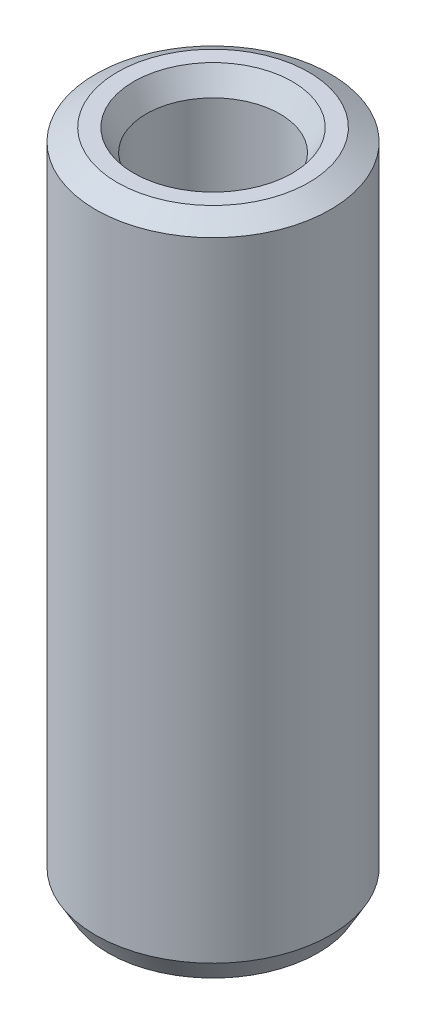
ISO-10303-21;
HEADER;
FILE_DESCRIPTION(('STEP AP214'),'2;1');
FILE_NAME('part.step','',(''),(''),'','','');
FILE_SCHEMA(('AUTOMOTIVE_DESIGN { 1 0 10303 214 1 1 1 1 }'));
ENDSEC;
DATA;
#1=APPLICATION_CONTEXT('core data for automotive mechanical design processes');
#2=APPLICATION_PROTOCOL_DEFINITION('international standard','automotive_design',2000,#1);
#3=PRODUCT_CONTEXT('',#1,'mechanical');
#4=PRODUCT('Part','Part','',(#3));
#5=PRODUCT_RELATED_PRODUCT_CATEGORY('part','',(#4));
#6=PRODUCT_DEFINITION_FORMATION('','',#4);
#7=PRODUCT_DEFINITION_CONTEXT('part definition',#1,'design');
#8=PRODUCT_DEFINITION('design','',#6,#7);
#9=PRODUCT_DEFINITION_SHAPE('','',#8);
#10=(LENGTH_UNIT() NAMED_UNIT(*) SI_UNIT(.MILLI.,.METRE.));
#11=(NAMED_UNIT(*) PLANE_ANGLE_UNIT() SI_UNIT($,.RADIAN.));
#12=(NAMED_UNIT(*) SI_UNIT($,.STERADIAN.) SOLID_ANGLE_UNIT());
#13=UNCERTAINTY_MEASURE_WITH_UNIT(LENGTH_MEASURE(1.E-05),#10,'distance_accuracy_value','');
#14=(GEOMETRIC_REPRESENTATION_CONTEXT(3) GLOBAL_UNCERTAINTY_ASSIGNED_CONTEXT((#13)) GLOBAL_UNIT_ASSIGNED_CONTEXT((#10,
#11,#12)) REPRESENTATION_CONTEXT('',''));
#15=CARTESIAN_POINT('',(0.,0.,0.));
#16=DIRECTION('',(0.,0.,1.));
#17=DIRECTION('',(1.,0.,0.));
#18=AXIS2_PLACEMENT_3D('',#15,#16,#17);
#19=CARTESIAN_POINT('',(0.,112.831708048129,0.));
#20=DIRECTION('',(0.,-1.,0.));
#21=DIRECTION('',(0.,0.,-1.));
#22=AXIS2_PLACEMENT_3D('',#19,#20,#21);
#23=CYLINDRICAL_SURFACE('',#22,20.);
#24=CARTESIAN_POINT('',(0.,3.69726768255808,0.));
#25=DIRECTION('',(0.,1.,0.));
#26=DIRECTION('',(0.,0.,1.));
#27=AXIS2_PLACEMENT_3D('',#24,#25,#26);
#28=CIRCLE('',#27,20.);
#29=CARTESIAN_POINT('',(0.,3.69726768255808,20.));
#30=VERTEX_POINT('',#29);
#31=EDGE_CURVE('E10',#30,#30,#28,.T.);
#32=ORIENTED_EDGE('',*,*,#31,.T.);
#33=EDGE_LOOP('',(#32));
#34=FACE_BOUND('',#33,.T.);
#35=CARTESIAN_POINT('',(0.,110.697089556338,0.));
#36=DIRECTION('',(0.,1.,0.));
#37=DIRECTION('',(0.,0.,1.));
#38=AXIS2_PLACEMENT_3D('',#35,#36,#37);
#39=CIRCLE('',#38,20.);
#40=CARTESIAN_POINT('',(0.,110.697089556338,20.));
#41=VERTEX_POINT('',#40);
#42=EDGE_CURVE('E50',#41,#41,#39,.F.);
#43=ORIENTED_EDGE('',*,*,#42,.T.);
#44=EDGE_LOOP('',(#43));
#45=FACE_BOUND('',#44,.T.);
#46=ADVANCED_FACE('F39',(#34,#45),#23,.T.);
#47=CARTESIAN_POINT('',(0.,112.831708048129,0.));
#48=DIRECTION('',(0.,1.,0.));
#49=DIRECTION('',(0.,0.,1.));
#50=AXIS2_PLACEMENT_3D('',#47,#48,#49);
#51=PLANE('',#50);
#52=CARTESIAN_POINT('',(0.,112.831708048129,0.));
#53=DIRECTION('',(0.,1.,0.));
#54=DIRECTION('',(0.,0.,1.));
#55=AXIS2_PLACEMENT_3D('',#52,#53,#54);
#56=CIRCLE('',#55,13.5146032053586);
#57=CARTESIAN_POINT('',(0.,112.831708048129,13.5146032053586));
#58=VERTEX_POINT('',#57);
#59=EDGE_CURVE('E58',#58,#58,#56,.F.);
#60=ORIENTED_EDGE('',*,*,#59,.T.);
#61=EDGE_LOOP('',(#60));
#62=FACE_BOUND('',#61,.T.);
#63=CARTESIAN_POINT('',(0.,112.831708048129,0.));
#64=DIRECTION('',(0.,1.,0.));
#65=DIRECTION('',(0.,0.,1.));
#66=AXIS2_PLACEMENT_3D('',#63,#64,#65);
#67=CIRCLE('',#66,16.3027323174419);
#68=CARTESIAN_POINT('',(0.,112.831708048129,16.3027323174419));
#69=VERTEX_POINT('',#68);
#70=EDGE_CURVE('E61',#69,#69,#67,.T.);
#71=ORIENTED_EDGE('',*,*,#70,.T.);
#72=EDGE_LOOP('',(#71));
#73=FACE_BOUND('',#72,.T.);
#74=ADVANCED_FACE('F88',(#62,#73),#51,.T.);
#75=CARTESIAN_POINT('',(0.,0.,0.));
#76=DIRECTION('',(0.,1.,0.));
#77=DIRECTION('',(0.,0.,1.));
#78=AXIS2_PLACEMENT_3D('',#75,#76,#77);
#79=PLANE('',#78);
#80=CARTESIAN_POINT('',(0.,0.,0.));
#81=DIRECTION('',(0.,1.,0.));
#82=DIRECTION('',(0.,0.,1.));
#83=AXIS2_PLACEMENT_3D('',#80,#81,#82);
#84=CIRCLE('',#83,15.0772523961257);
#85=CARTESIAN_POINT('',(0.,0.,15.0772523961257));
#86=VERTEX_POINT('',#85);
#87=EDGE_CURVE('E51',#86,#86,#84,.T.);
#88=ORIENTED_EDGE('',*,*,#87,.T.);
#89=EDGE_LOOP('',(#88));
#90=FACE_BOUND('',#89,.T.);
#91=CARTESIAN_POINT('',(0.,0.,0.));
#92=DIRECTION('',(0.,1.,0.));
#93=DIRECTION('',(0.,0.,1.));
#94=AXIS2_PLACEMENT_3D('',#91,#92,#93);
#95=CIRCLE('',#94,17.865381508209);
#96=CARTESIAN_POINT('',(0.,0.,17.865381508209));
#97=VERTEX_POINT('',#96);
#98=EDGE_CURVE('E54',#97,#97,#95,.F.);
#99=ORIENTED_EDGE('',*,*,#98,.T.);
#100=EDGE_LOOP('',(#99));
#101=FACE_BOUND('',#100,.T.);
#102=ADVANCED_FACE('F83',(#90,#101),#79,.F.);
#103=CARTESIAN_POINT('',(0.,112.831708048129,0.));
#104=DIRECTION('',(0.,-1.,0.));
#105=DIRECTION('',(0.,0.,-1.));
#106=AXIS2_PLACEMENT_3D('',#103,#104,#105);
#107=CYLINDRICAL_SURFACE('',#106,11.3799847135676);
#108=CARTESIAN_POINT('',(0.,109.134440365571,0.));
#109=DIRECTION('',(0.,1.,0.));
#110=DIRECTION('',(0.,0.,1.));
#111=AXIS2_PLACEMENT_3D('',#108,#109,#110);
#112=CIRCLE('',#111,11.3799847135676);
#113=CARTESIAN_POINT('',(0.,109.134440365571,11.3799847135676));
#114=VERTEX_POINT('',#113);
#115=EDGE_CURVE('E67',#114,#114,#112,.T.);
#116=ORIENTED_EDGE('',*,*,#115,.T.);
#117=EDGE_LOOP('',(#116));
#118=FACE_BOUND('',#117,.T.);
#119=CARTESIAN_POINT('',(0.,2.13461849179103,0.));
#120=DIRECTION('',(0.,1.,0.));
#121=DIRECTION('',(0.,0.,1.));
#122=AXIS2_PLACEMENT_3D('',#119,#120,#121);
#123=CIRCLE('',#122,11.3799847135676);
#124=CARTESIAN_POINT('',(0.,2.13461849179103,11.3799847135676));
#125=VERTEX_POINT('',#124);
#126=EDGE_CURVE('E69',#125,#125,#123,.F.);
#127=ORIENTED_EDGE('',*,*,#126,.T.);
#128=EDGE_LOOP('',(#127));
#129=FACE_BOUND('',#128,.T.);
#130=ADVANCED_FACE('F71',(#118,#129),#107,.F.);
#131=CARTESIAN_POINT('',(0.,109.134440365571,0.));
#132=DIRECTION('',(0.,1.,0.));
#133=DIRECTION('',(0.,0.,1.));
#134=AXIS2_PLACEMENT_3D('',#131,#132,#133);
#135=CONICAL_SURFACE('',#134,11.3799847135676,0.523598775598305);
#136=ORIENTED_EDGE('',*,*,#59,.F.);
#137=EDGE_LOOP('',(#136));
#138=FACE_BOUND('',#137,.T.);
#139=ORIENTED_EDGE('',*,*,#115,.F.);
#140=EDGE_LOOP('',(#139));
#141=FACE_BOUND('',#140,.T.);
#142=ADVANCED_FACE('F77',(#138,#141),#135,.F.);
#143=CARTESIAN_POINT('',(0.,0.,0.));
#144=DIRECTION('',(0.,-1.,0.));
#145=DIRECTION('',(0.,0.,-1.));
#146=AXIS2_PLACEMENT_3D('',#143,#144,#145);
#147=CONICAL_SURFACE('',#146,15.0772523961257,1.04719755119659);
#148=ORIENTED_EDGE('',*,*,#126,.F.);
#149=EDGE_LOOP('',(#148));
#150=FACE_BOUND('',#149,.T.);
#151=ORIENTED_EDGE('',*,*,#87,.F.);
#152=EDGE_LOOP('',(#151));
#153=FACE_BOUND('',#152,.T.);
#154=ADVANCED_FACE('F73',(#150,#153),#147,.F.);
#155=CARTESIAN_POINT('',(0.,3.69726768255808,0.));
#156=DIRECTION('',(0.,1.,0.));
#157=DIRECTION('',(0.,0.,1.));
#158=AXIS2_PLACEMENT_3D('',#155,#156,#157);
#159=CONICAL_SURFACE('',#158,20.,0.523598775598304);
#160=CARTESIAN_POINT('',(0.,0.,17.865381508209));
#161=CARTESIAN_POINT('',(0.,0.0385132050266466,17.8876171174985));
#162=CARTESIAN_POINT('',(0.,0.0770264100532933,17.9098527267879));
#163=CARTESIAN_POINT('',(0.,0.154052820106587,17.9543239453669));
#164=CARTESIAN_POINT('',(0.,0.192566025133233,17.9765595546564));
#165=CARTESIAN_POINT('',(0.,0.269592435186526,18.0210307732354));
#166=CARTESIAN_POINT('',(0.,0.308105640213173,18.0432663825249));
#167=CARTESIAN_POINT('',(0.,0.385132050266466,18.0877376011039));
#168=CARTESIAN_POINT('',(0.,0.423645255293113,18.1099732103933));
#169=CARTESIAN_POINT('',(0.,0.500671665346407,18.1544444289723));
#170=CARTESIAN_POINT('',(0.,0.539184870373054,18.1766800382618));
#171=CARTESIAN_POINT('',(0.,0.616211280426347,18.2211512568408));
#172=CARTESIAN_POINT('',(0.,0.654724485452993,18.2433868661303));
#173=CARTESIAN_POINT('',(0.,0.731750895506287,18.2878580847093));
#174=CARTESIAN_POINT('',(0.,0.770264100532934,18.3100936939988));
#175=CARTESIAN_POINT('',(0.,0.847290510586227,18.3545649125777));
#176=CARTESIAN_POINT('',(0.,0.885803715612873,18.3768005218672));
#177=CARTESIAN_POINT('',(0.,0.962830125666167,18.4212717404462));
#178=CARTESIAN_POINT('',(0.,1.00134333069281,18.4435073497357));
#179=CARTESIAN_POINT('',(0.,1.07836974074611,18.4879785683147));
#180=CARTESIAN_POINT('',(0.,1.11688294577275,18.5102141776042));
#181=CARTESIAN_POINT('',(0.,1.19390935582605,18.5546853961831));
#182=CARTESIAN_POINT('',(0.,1.23242256085269,18.5769210054726));
#183=CARTESIAN_POINT('',(0.,1.30944897090599,18.6213922240516));
#184=CARTESIAN_POINT('',(0.,1.34796217593263,18.6436278333411));
#185=CARTESIAN_POINT('',(0.,1.42498858598593,18.6880990519201));
#186=CARTESIAN_POINT('',(0.,1.46350179101257,18.7103346612096));
#187=CARTESIAN_POINT('',(0.,1.54052820106587,18.7548058797886));
#188=CARTESIAN_POINT('',(0.,1.57904140609251,18.7770414890781));
#189=CARTESIAN_POINT('',(0.,1.65606781614581,18.821512707657));
#190=CARTESIAN_POINT('',(0.,1.69458102117245,18.8437483169465));
#191=CARTESIAN_POINT('',(0.,1.77160743122575,18.8882195355255));
#192=CARTESIAN_POINT('',(0.,1.81012063625239,18.910455144815));
#193=CARTESIAN_POINT('',(0.,1.88714704630569,18.954926363394));
#194=CARTESIAN_POINT('',(0.,1.92566025133233,18.9771619726835));
#195=CARTESIAN_POINT('',(0.,2.00268666138563,19.0216331912624));
#196=CARTESIAN_POINT('',(0.,2.04119986641228,19.0438688005519));
#197=CARTESIAN_POINT('',(0.,2.11822627646557,19.0883400191309));
#198=CARTESIAN_POINT('',(0.,2.15673948149222,19.1105756284204));
#199=CARTESIAN_POINT('',(0.,2.23376589154551,19.1550468469994));
#200=CARTESIAN_POINT('',(0.,2.27227909657215,19.1772824562889));
#201=CARTESIAN_POINT('',(0.,2.34930550662545,19.2217536748679));
#202=CARTESIAN_POINT('',(0.,2.3878187116521,19.2439892841573));
#203=CARTESIAN_POINT('',(0.,2.46484512170539,19.2884605027363));
#204=CARTESIAN_POINT('',(0.,2.50335832673204,19.3106961120258));
#205=CARTESIAN_POINT('',(0.,2.58038473678533,19.3551673306048));
#206=CARTESIAN_POINT('',(0.,2.61889794181198,19.3774029398943));
#207=CARTESIAN_POINT('',(0.,2.69592435186527,19.4218741584733));
#208=CARTESIAN_POINT('',(0.,2.73443755689192,19.4441097677628));
#209=CARTESIAN_POINT('',(0.,2.81146396694521,19.4885809863417));
#210=CARTESIAN_POINT('',(0.,2.84997717197186,19.5108165956312));
#211=CARTESIAN_POINT('',(0.,2.92700358202515,19.5552878142102));
#212=CARTESIAN_POINT('',(0.,2.9655167870518,19.5775234234997));
#213=CARTESIAN_POINT('',(0.,3.04254319710509,19.6219946420787));
#214=CARTESIAN_POINT('',(0.,3.08105640213174,19.6442302513682));
#215=CARTESIAN_POINT('',(0.,3.15808281218503,19.6887014699471));
#216=CARTESIAN_POINT('',(0.,3.19659601721168,19.7109370792366));
#217=CARTESIAN_POINT('',(0.,3.27362242726497,19.7554082978156));
#218=CARTESIAN_POINT('',(0.,3.31213563229162,19.7776439071051));
#219=CARTESIAN_POINT('',(0.,3.38916204234491,19.8221151256841));
#220=CARTESIAN_POINT('',(0.,3.42767524737156,19.8443507349736));
#221=CARTESIAN_POINT('',(0.,3.50470165742485,19.8888219535526));
#222=CARTESIAN_POINT('',(0.,3.5432148624515,19.911057562842));
#223=CARTESIAN_POINT('',(0.,3.62024127250479,19.955528781421));
#224=CARTESIAN_POINT('',(0.,3.65875447753144,19.9777643907105));
#225=CARTESIAN_POINT('',(0.,3.69726768255808,20.));
#226=B_SPLINE_CURVE_WITH_KNOTS('',3,(#160,#161,#162,#163,#164,#165,#166,#167,#168,#169,#170,
#171,#172,#173,#174,#175,#176,#177,#178,#179,#180,#181,#182,#183,#184,#185,#186,#187,#188,#189,
#190,#191,#192,#193,#194,#195,#196,#197,#198,#199,#200,#201,#202,#203,#204,#205,#206,#207,#208,
#209,#210,#211,#212,#213,#214,#215,#216,#217,#218,#219,#220,#221,#222,#223,#224,#225),
.UNSPECIFIED.,.F.,.F.,(4,2,2,2,2,2,2,2,2,2,2,2,2,2,2,2,2,2,2,2,2,2,2,2,2,2,2,2,2,2,2,2,4),(0.,
0.133413655736938,0.266827311473877,0.400240967210817,0.533654622947754,0.667068278684694,
0.800481934421633,0.933895590158571,1.06730924589551,1.20072290163245,1.33413655736939,
1.46755021310633,1.60096386884326,1.7343775245802,1.86779118031714,2.00120483605408,
2.13461849179102,2.26803214752796,2.4014458032649,2.53485945900184,2.66827311473878,
2.80168677047571,2.93510042621265,3.06851408194959,3.20192773768653,3.33534139342347,
3.46875504916041,3.60216870489734,3.73558236063428,3.86899601637122,4.00240967210816,
4.1358233278451,4.26923698358204),.UNSPECIFIED.);
#227=EDGE_CURVE('BSEAM76',#97,#30,#226,.T.);
#228=ORIENTED_EDGE('',*,*,#98,.F.);
#229=ORIENTED_EDGE('',*,*,#31,.F.);
#230=ORIENTED_EDGE('',*,*,#227,.T.);
#231=ORIENTED_EDGE('',*,*,#227,.F.);
#232=EDGE_LOOP('',(#228,#230,#229,#231));
#233=FACE_BOUND('',#232,.T.);
#234=ADVANCED_FACE('F76',(#233),#159,.T.);
#235=CARTESIAN_POINT('',(0.,112.831708048129,0.));
#236=DIRECTION('',(0.,-1.,0.));
#237=DIRECTION('',(0.,0.,-1.));
#238=AXIS2_PLACEMENT_3D('',#235,#236,#237);
#239=CONICAL_SURFACE('',#238,16.3027323174419,1.04719755119659);
#240=ORIENTED_EDGE('',*,*,#42,.F.);
#241=EDGE_LOOP('',(#240));
#242=FACE_BOUND('',#241,.T.);
#243=ORIENTED_EDGE('',*,*,#70,.F.);
#244=EDGE_LOOP('',(#243));
#245=FACE_BOUND('',#244,.T.);
#246=ADVANCED_FACE('F45',(#242,#245),#239,.T.);
#247=CLOSED_SHELL('',(#46,#74,#102,#130,#142,#154,#234,#246));
#248=MANIFOLD_SOLID_BREP('B2',#247);
#249=ADVANCED_BREP_SHAPE_REPRESENTATION('',(#18,#248),#14);
#250=SHAPE_DEFINITION_REPRESENTATION(#9,#249);
ENDSEC;
END-ISO-10303-21;
